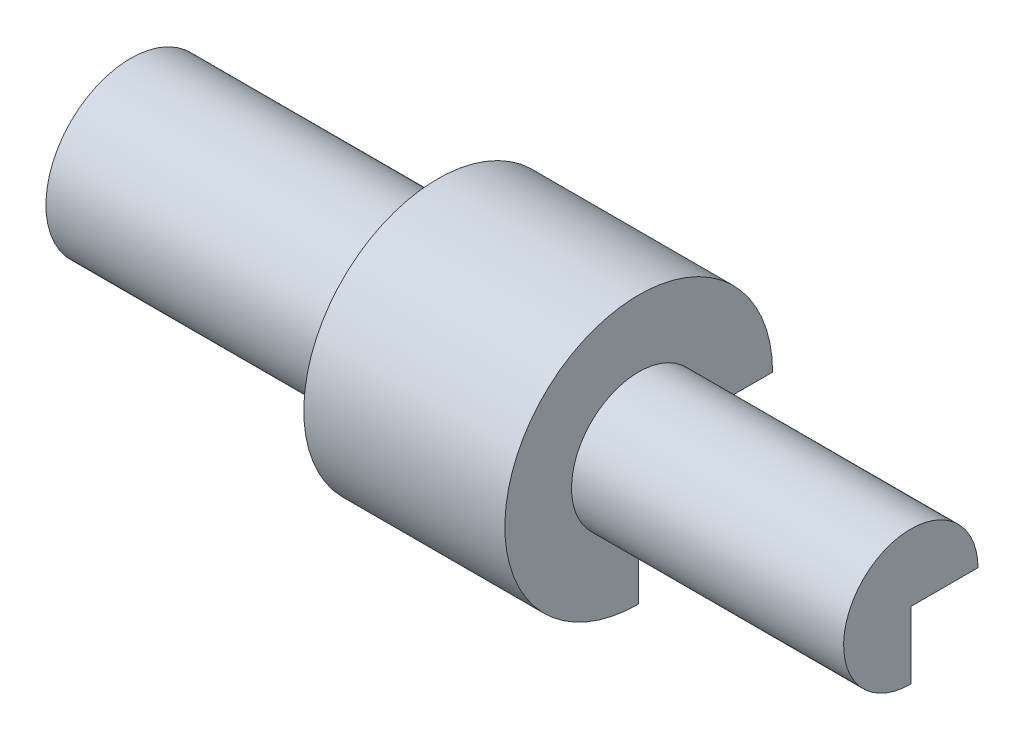
ISO-10303-21;
HEADER;
FILE_DESCRIPTION(('STEP AP214'),'2;1');
FILE_NAME('part.step','',(''),(''),'','','');
FILE_SCHEMA(('AUTOMOTIVE_DESIGN { 1 0 10303 214 1 1 1 1 }'));
ENDSEC;
DATA;
#1=APPLICATION_CONTEXT('core data for automotive mechanical design processes');
#2=APPLICATION_PROTOCOL_DEFINITION('international standard','automotive_design',2000,#1);
#3=PRODUCT_CONTEXT('',#1,'mechanical');
#4=PRODUCT('Part','Part','',(#3));
#5=PRODUCT_RELATED_PRODUCT_CATEGORY('part','',(#4));
#6=PRODUCT_DEFINITION_FORMATION('','',#4);
#7=PRODUCT_DEFINITION_CONTEXT('part definition',#1,'design');
#8=PRODUCT_DEFINITION('design','',#6,#7);
#9=PRODUCT_DEFINITION_SHAPE('','',#8);
#10=(LENGTH_UNIT() NAMED_UNIT(*) SI_UNIT(.MILLI.,.METRE.));
#11=(NAMED_UNIT(*) PLANE_ANGLE_UNIT() SI_UNIT($,.RADIAN.));
#12=(NAMED_UNIT(*) SI_UNIT($,.STERADIAN.) SOLID_ANGLE_UNIT());
#13=UNCERTAINTY_MEASURE_WITH_UNIT(LENGTH_MEASURE(1.E-05),#10,'distance_accuracy_value','');
#14=(GEOMETRIC_REPRESENTATION_CONTEXT(3) GLOBAL_UNCERTAINTY_ASSIGNED_CONTEXT((#13)) GLOBAL_UNIT_ASSIGNED_CONTEXT((#10,
#11,#12)) REPRESENTATION_CONTEXT('',''));
#15=CARTESIAN_POINT('',(0.,0.,0.));
#16=DIRECTION('',(0.,0.,1.));
#17=DIRECTION('',(1.,0.,0.));
#18=AXIS2_PLACEMENT_3D('',#15,#16,#17);
#19=CARTESIAN_POINT('',(0.,0.,0.));
#20=DIRECTION('',(-1.,0.,0.));
#21=DIRECTION('',(0.,0.,1.));
#22=AXIS2_PLACEMENT_3D('',#19,#20,#21);
#23=PLANE('',#22);
#24=DIRECTION('',(0.,0.,-1.));
#25=VECTOR('',#24,1.);
#26=CARTESIAN_POINT('',(0.,0.,0.));
#27=LINE('',#26,#25);
#28=CARTESIAN_POINT('',(0.,0.,0.));
#29=VERTEX_POINT('',#28);
#30=CARTESIAN_POINT('',(0.,0.,-32.5503417358712));
#31=VERTEX_POINT('',#30);
#32=EDGE_CURVE('E145',#29,#31,#27,.T.);
#33=ORIENTED_EDGE('',*,*,#32,.F.);
#34=DIRECTION('',(0.,-1.,0.));
#35=VECTOR('',#34,1.);
#36=CARTESIAN_POINT('',(0.,0.,0.));
#37=LINE('',#36,#35);
#38=CARTESIAN_POINT('',(0.,-32.5503417358712,-3.40946732231284E-13));
#39=VERTEX_POINT('',#38);
#40=EDGE_CURVE('E189',#29,#39,#37,.T.);
#41=ORIENTED_EDGE('',*,*,#40,.T.);
#42=CARTESIAN_POINT('',(0.,0.,0.));
#43=DIRECTION('',(-1.,0.,0.));
#44=DIRECTION('',(0.,0.,1.));
#45=AXIS2_PLACEMENT_3D('',#42,#43,#44);
#46=CIRCLE('',#45,32.5503417358712);
#47=EDGE_CURVE('E55',#39,#31,#46,.T.);
#48=ORIENTED_EDGE('',*,*,#47,.T.);
#49=EDGE_LOOP('',(#33,#41,#48));
#50=FACE_BOUND('',#49,.T.);
#51=ADVANCED_FACE('F39',(#50),#23,.T.);
#52=CARTESIAN_POINT('',(15.1936210798169,0.,0.));
#53=DIRECTION('',(-1.,0.,0.));
#54=DIRECTION('',(0.,0.,1.));
#55=AXIS2_PLACEMENT_3D('',#52,#53,#54);
#56=PLANE('',#55);
#57=CARTESIAN_POINT('',(15.1936210798169,0.,0.));
#58=DIRECTION('',(-1.,0.,0.));
#59=DIRECTION('',(0.,0.,1.));
#60=AXIS2_PLACEMENT_3D('',#57,#58,#59);
#61=CIRCLE('',#60,18.2010773859513);
#62=CARTESIAN_POINT('',(15.1936210798169,-18.2010773859513,-1.90646166119667E-13));
#63=VERTEX_POINT('',#62);
#64=CARTESIAN_POINT('',(15.1936210798169,0.,-18.2010773859513));
#65=VERTEX_POINT('',#64);
#66=EDGE_CURVE('E11',#63,#65,#61,.T.);
#67=ORIENTED_EDGE('',*,*,#66,.F.);
#68=DIRECTION('',(0.,-1.,0.));
#69=VECTOR('',#68,1.);
#70=CARTESIAN_POINT('',(15.1936210798169,0.,0.));
#71=LINE('',#70,#69);
#72=CARTESIAN_POINT('',(15.1936210798169,0.,0.));
#73=VERTEX_POINT('',#72);
#74=EDGE_CURVE('E141',#73,#63,#71,.T.);
#75=ORIENTED_EDGE('',*,*,#74,.F.);
#76=DIRECTION('',(0.,0.,-1.));
#77=VECTOR('',#76,1.);
#78=CARTESIAN_POINT('',(15.1936210798169,0.,0.));
#79=LINE('',#78,#77);
#80=EDGE_CURVE('E140',#73,#65,#79,.T.);
#81=ORIENTED_EDGE('',*,*,#80,.T.);
#82=EDGE_LOOP('',(#67,#75,#81));
#83=FACE_BOUND('',#82,.T.);
#84=ADVANCED_FACE('F41',(#83),#56,.F.);
#85=CARTESIAN_POINT('',(0.,0.,0.));
#86=DIRECTION('',(-1.,0.,0.));
#87=DIRECTION('',(0.,0.,1.));
#88=AXIS2_PLACEMENT_3D('',#85,#86,#87);
#89=CYLINDRICAL_SURFACE('',#88,18.2010773859513);
#90=CARTESIAN_POINT('',(199.080833897966,0.,0.));
#91=DIRECTION('',(-1.,0.,0.));
#92=DIRECTION('',(0.,0.,1.));
#93=AXIS2_PLACEMENT_3D('',#90,#91,#92);
#94=CIRCLE('',#93,18.2010773859513);
#95=CARTESIAN_POINT('',(199.080833897966,-18.2010773859513,-1.90646166119667E-13));
#96=VERTEX_POINT('',#95);
#97=CARTESIAN_POINT('',(199.080833897966,0.,-18.2010773859513));
#98=VERTEX_POINT('',#97);
#99=EDGE_CURVE('E48',#96,#98,#94,.T.);
#100=ORIENTED_EDGE('',*,*,#99,.F.);
#101=DIRECTION('',(1.,0.,0.));
#102=VECTOR('',#101,1.);
#103=CARTESIAN_POINT('',(0.,-18.2010773859513,-1.90646166119667E-13));
#104=LINE('',#103,#102);
#105=EDGE_CURVE('E136',#63,#96,#104,.T.);
#106=ORIENTED_EDGE('',*,*,#105,.F.);
#107=ORIENTED_EDGE('',*,*,#66,.T.);
#108=DIRECTION('',(1.,0.,0.));
#109=VECTOR('',#108,1.);
#110=CARTESIAN_POINT('',(0.,0.,-18.2010773859513));
#111=LINE('',#110,#109);
#112=EDGE_CURVE('E133',#65,#98,#111,.T.);
#113=ORIENTED_EDGE('',*,*,#112,.T.);
#114=EDGE_LOOP('',(#100,#106,#107,#113));
#115=FACE_BOUND('',#114,.T.);
#116=ADVANCED_FACE('F131',(#115),#89,.F.);
#117=CARTESIAN_POINT('',(199.080833897966,0.,0.));
#118=DIRECTION('',(1.,0.,0.));
#119=DIRECTION('',(0.,0.,-1.));
#120=AXIS2_PLACEMENT_3D('',#117,#118,#119);
#121=PLANE('',#120);
#122=CARTESIAN_POINT('',(199.080833897966,0.,0.));
#123=DIRECTION('',(-1.,0.,0.));
#124=DIRECTION('',(0.,0.,1.));
#125=AXIS2_PLACEMENT_3D('',#122,#123,#124);
#126=CIRCLE('',#125,9.10053869297567);
#127=CARTESIAN_POINT('',(199.080833897966,-9.10053869297567,0.));
#128=VERTEX_POINT('',#127);
#129=CARTESIAN_POINT('',(199.080833897966,0.,-9.10053869297567));
#130=VERTEX_POINT('',#129);
#131=EDGE_CURVE('E253',#128,#130,#126,.T.);
#132=ORIENTED_EDGE('',*,*,#131,.F.);
#133=DIRECTION('',(0.,1.,0.));
#134=VECTOR('',#133,1.);
#135=CARTESIAN_POINT('',(199.080833897966,0.,0.));
#136=LINE('',#135,#134);
#137=EDGE_CURVE('E200',#96,#128,#136,.T.);
#138=ORIENTED_EDGE('',*,*,#137,.F.);
#139=ORIENTED_EDGE('',*,*,#99,.T.);
#140=DIRECTION('',(0.,0.,1.));
#141=VECTOR('',#140,1.);
#142=CARTESIAN_POINT('',(199.080833897966,0.,0.));
#143=LINE('',#142,#141);
#144=EDGE_CURVE('E151',#98,#130,#143,.T.);
#145=ORIENTED_EDGE('',*,*,#144,.T.);
#146=EDGE_LOOP('',(#132,#138,#139,#145));
#147=FACE_BOUND('',#146,.T.);
#148=ADVANCED_FACE('F258',(#147),#121,.F.);
#149=CARTESIAN_POINT('',(0.,0.,0.));
#150=DIRECTION('',(-1.,0.,0.));
#151=DIRECTION('',(0.,0.,1.));
#152=AXIS2_PLACEMENT_3D('',#149,#150,#151);
#153=CYLINDRICAL_SURFACE('',#152,9.10053869297567);
#154=CARTESIAN_POINT('',(279.725137873243,0.,0.));
#155=DIRECTION('',(-1.,0.,0.));
#156=DIRECTION('',(0.,0.,1.));
#157=AXIS2_PLACEMENT_3D('',#154,#155,#156);
#158=CIRCLE('',#157,9.10053869297567);
#159=CARTESIAN_POINT('',(279.725137873243,-9.10053869297567,0.));
#160=VERTEX_POINT('',#159);
#161=CARTESIAN_POINT('',(279.725137873243,0.,-9.10053869297567));
#162=VERTEX_POINT('',#161);
#163=EDGE_CURVE('E250',#160,#162,#158,.T.);
#164=ORIENTED_EDGE('',*,*,#163,.F.);
#165=DIRECTION('',(1.,0.,0.));
#166=VECTOR('',#165,1.);
#167=CARTESIAN_POINT('',(0.,-9.10053869297567,0.));
#168=LINE('',#167,#166);
#169=EDGE_CURVE('E204',#128,#160,#168,.T.);
#170=ORIENTED_EDGE('',*,*,#169,.F.);
#171=ORIENTED_EDGE('',*,*,#131,.T.);
#172=DIRECTION('',(1.,0.,0.));
#173=VECTOR('',#172,1.);
#174=CARTESIAN_POINT('',(0.,0.,-9.10053869297567));
#175=LINE('',#174,#173);
#176=EDGE_CURVE('E155',#130,#162,#175,.T.);
#177=ORIENTED_EDGE('',*,*,#176,.T.);
#178=EDGE_LOOP('',(#164,#170,#171,#177));
#179=FACE_BOUND('',#178,.T.);
#180=ADVANCED_FACE('F297',(#179),#153,.F.);
#181=CARTESIAN_POINT('',(279.725137873243,0.,0.));
#182=DIRECTION('',(1.,0.,0.));
#183=DIRECTION('',(0.,0.,-1.));
#184=AXIS2_PLACEMENT_3D('',#181,#182,#183);
#185=PLANE('',#184);
#186=DIRECTION('',(0.,0.,1.));
#187=VECTOR('',#186,1.);
#188=CARTESIAN_POINT('',(279.725137873243,0.,0.));
#189=LINE('',#188,#187);
#190=CARTESIAN_POINT('',(279.725137873243,0.,0.));
#191=VERTEX_POINT('',#190);
#192=EDGE_CURVE('E162',#162,#191,#189,.T.);
#193=ORIENTED_EDGE('',*,*,#192,.T.);
#194=DIRECTION('',(0.,1.,0.));
#195=VECTOR('',#194,1.);
#196=CARTESIAN_POINT('',(279.725137873243,0.,0.));
#197=LINE('',#196,#195);
#198=EDGE_CURVE('E208',#160,#191,#197,.T.);
#199=ORIENTED_EDGE('',*,*,#198,.F.);
#200=ORIENTED_EDGE('',*,*,#163,.T.);
#201=EDGE_LOOP('',(#193,#199,#200));
#202=FACE_BOUND('',#201,.T.);
#203=ADVANCED_FACE('F290',(#202),#185,.F.);
#204=CARTESIAN_POINT('',(299.890300866906,0.,0.));
#205=DIRECTION('',(1.,0.,0.));
#206=DIRECTION('',(0.,0.,-1.));
#207=AXIS2_PLACEMENT_3D('',#204,#205,#206);
#208=PLANE('',#207);
#209=CARTESIAN_POINT('',(299.890300866906,0.,0.));
#210=DIRECTION('',(-1.,0.,0.));
#211=DIRECTION('',(0.,0.,1.));
#212=AXIS2_PLACEMENT_3D('',#209,#210,#211);
#213=CIRCLE('',#212,25.8302711839494);
#214=CARTESIAN_POINT('',(299.890300866906,-25.8302711839494,-2.70557729448051E-13));
#215=VERTEX_POINT('',#214);
#216=CARTESIAN_POINT('',(299.890300866906,0.,-25.8302711839494));
#217=VERTEX_POINT('',#216);
#218=EDGE_CURVE('E247',#215,#217,#213,.T.);
#219=ORIENTED_EDGE('',*,*,#218,.F.);
#220=DIRECTION('',(0.,1.,0.));
#221=VECTOR('',#220,1.);
#222=CARTESIAN_POINT('',(299.890300866906,0.,0.));
#223=LINE('',#222,#221);
#224=CARTESIAN_POINT('',(299.890300866906,0.,0.));
#225=VERTEX_POINT('',#224);
#226=EDGE_CURVE('E212',#215,#225,#223,.T.);
#227=ORIENTED_EDGE('',*,*,#226,.T.);
#228=DIRECTION('',(0.,0.,1.));
#229=VECTOR('',#228,1.);
#230=CARTESIAN_POINT('',(299.890300866906,0.,0.));
#231=LINE('',#230,#229);
#232=EDGE_CURVE('E166',#217,#225,#231,.T.);
#233=ORIENTED_EDGE('',*,*,#232,.F.);
#234=EDGE_LOOP('',(#219,#227,#233));
#235=FACE_BOUND('',#234,.T.);
#236=ADVANCED_FACE('F288',(#235),#208,.T.);
#237=CARTESIAN_POINT('',(0.,0.,0.));
#238=DIRECTION('',(-1.,0.,0.));
#239=DIRECTION('',(0.,0.,1.));
#240=AXIS2_PLACEMENT_3D('',#237,#238,#239);
#241=CYLINDRICAL_SURFACE('',#240,25.8302711839494);
#242=CARTESIAN_POINT('',(195.302050415228,0.,0.));
#243=DIRECTION('',(-1.,0.,0.));
#244=DIRECTION('',(0.,0.,1.));
#245=AXIS2_PLACEMENT_3D('',#242,#243,#244);
#246=CIRCLE('',#245,25.8302711839494);
#247=CARTESIAN_POINT('',(195.302050415228,-25.8302711839494,-2.70557729448051E-13));
#248=VERTEX_POINT('',#247);
#249=CARTESIAN_POINT('',(195.302050415228,0.,-25.8302711839494));
#250=VERTEX_POINT('',#249);
#251=EDGE_CURVE('E244',#248,#250,#246,.T.);
#252=ORIENTED_EDGE('',*,*,#251,.F.);
#253=DIRECTION('',(1.,0.,0.));
#254=VECTOR('',#253,1.);
#255=CARTESIAN_POINT('',(0.,-25.8302711839494,-2.70557729448051E-13));
#256=LINE('',#255,#254);
#257=EDGE_CURVE('E216',#248,#215,#256,.T.);
#258=ORIENTED_EDGE('',*,*,#257,.T.);
#259=ORIENTED_EDGE('',*,*,#218,.T.);
#260=DIRECTION('',(1.,0.,0.));
#261=VECTOR('',#260,1.);
#262=CARTESIAN_POINT('',(0.,0.,-25.8302711839494));
#263=LINE('',#262,#261);
#264=EDGE_CURVE('E169',#250,#217,#263,.T.);
#265=ORIENTED_EDGE('',*,*,#264,.F.);
#266=EDGE_LOOP('',(#252,#258,#259,#265));
#267=FACE_BOUND('',#266,.T.);
#268=ADVANCED_FACE('F280',(#267),#241,.T.);
#269=CARTESIAN_POINT('',(195.302050415228,0.,0.));
#270=DIRECTION('',(1.,0.,0.));
#271=DIRECTION('',(0.,0.,-1.));
#272=AXIS2_PLACEMENT_3D('',#269,#270,#271);
#273=PLANE('',#272);
#274=CARTESIAN_POINT('',(195.302050415228,0.,0.));
#275=DIRECTION('',(-1.,0.,0.));
#276=DIRECTION('',(0.,0.,1.));
#277=AXIS2_PLACEMENT_3D('',#274,#275,#276);
#278=CIRCLE('',#277,51.4505401631513);
#279=CARTESIAN_POINT('',(195.302050415228,-51.4505401631513,-5.38915802559126E-13));
#280=VERTEX_POINT('',#279);
#281=CARTESIAN_POINT('',(195.302050415228,0.,-51.4505401631513));
#282=VERTEX_POINT('',#281);
#283=EDGE_CURVE('E241',#280,#282,#278,.T.);
#284=ORIENTED_EDGE('',*,*,#283,.F.);
#285=DIRECTION('',(0.,1.,0.));
#286=VECTOR('',#285,1.);
#287=CARTESIAN_POINT('',(195.302050415228,0.,0.));
#288=LINE('',#287,#286);
#289=EDGE_CURVE('E220',#280,#248,#288,.T.);
#290=ORIENTED_EDGE('',*,*,#289,.T.);
#291=ORIENTED_EDGE('',*,*,#251,.T.);
#292=DIRECTION('',(0.,0.,1.));
#293=VECTOR('',#292,1.);
#294=CARTESIAN_POINT('',(195.302050415228,0.,0.));
#295=LINE('',#294,#293);
#296=EDGE_CURVE('E173',#282,#250,#295,.T.);
#297=ORIENTED_EDGE('',*,*,#296,.F.);
#298=EDGE_LOOP('',(#284,#290,#291,#297));
#299=FACE_BOUND('',#298,.T.);
#300=ADVANCED_FACE('F276',(#299),#273,.T.);
#301=CARTESIAN_POINT('',(0.,0.,0.));
#302=DIRECTION('',(-1.,0.,0.));
#303=DIRECTION('',(0.,0.,1.));
#304=AXIS2_PLACEMENT_3D('',#301,#302,#303);
#305=CYLINDRICAL_SURFACE('',#304,51.4505401631513);
#306=CARTESIAN_POINT('',(118.021239068127,0.,0.));
#307=DIRECTION('',(-1.,0.,0.));
#308=DIRECTION('',(0.,0.,1.));
#309=AXIS2_PLACEMENT_3D('',#306,#307,#308);
#310=CIRCLE('',#309,51.4505401631513);
#311=CARTESIAN_POINT('',(118.021239068127,-51.4505401631513,-5.38915802559126E-13));
#312=VERTEX_POINT('',#311);
#313=CARTESIAN_POINT('',(118.021239068127,0.,-51.4505401631513));
#314=VERTEX_POINT('',#313);
#315=EDGE_CURVE('E238',#312,#314,#310,.T.);
#316=ORIENTED_EDGE('',*,*,#315,.F.);
#317=DIRECTION('',(1.,0.,0.));
#318=VECTOR('',#317,1.);
#319=CARTESIAN_POINT('',(0.,-51.4505401631513,-5.38915802559126E-13));
#320=LINE('',#319,#318);
#321=EDGE_CURVE('E224',#312,#280,#320,.T.);
#322=ORIENTED_EDGE('',*,*,#321,.T.);
#323=ORIENTED_EDGE('',*,*,#283,.T.);
#324=DIRECTION('',(1.,0.,0.));
#325=VECTOR('',#324,1.);
#326=CARTESIAN_POINT('',(0.,0.,-51.4505401631513));
#327=LINE('',#326,#325);
#328=EDGE_CURVE('E177',#314,#282,#327,.T.);
#329=ORIENTED_EDGE('',*,*,#328,.F.);
#330=EDGE_LOOP('',(#316,#322,#323,#329));
#331=FACE_BOUND('',#330,.T.);
#332=ADVANCED_FACE('F273',(#331),#305,.T.);
#333=CARTESIAN_POINT('',(118.021239068127,0.,0.));
#334=DIRECTION('',(-1.,0.,0.));
#335=DIRECTION('',(0.,0.,1.));
#336=AXIS2_PLACEMENT_3D('',#333,#334,#335);
#337=PLANE('',#336);
#338=CARTESIAN_POINT('',(118.021239068127,0.,0.));
#339=DIRECTION('',(-1.,0.,0.));
#340=DIRECTION('',(0.,0.,1.));
#341=AXIS2_PLACEMENT_3D('',#338,#339,#340);
#342=CIRCLE('',#341,32.5503417358712);
#343=CARTESIAN_POINT('',(118.021239068127,-32.5503417358712,-3.40946732231284E-13));
#344=VERTEX_POINT('',#343);
#345=CARTESIAN_POINT('',(118.021239068127,0.,-32.5503417358712));
#346=VERTEX_POINT('',#345);
#347=EDGE_CURVE('E63',#344,#346,#342,.T.);
#348=ORIENTED_EDGE('',*,*,#347,.F.);
#349=DIRECTION('',(0.,-1.,0.));
#350=VECTOR('',#349,1.);
#351=CARTESIAN_POINT('',(118.021239068127,0.,0.));
#352=LINE('',#351,#350);
#353=EDGE_CURVE('E228',#344,#312,#352,.T.);
#354=ORIENTED_EDGE('',*,*,#353,.T.);
#355=ORIENTED_EDGE('',*,*,#315,.T.);
#356=DIRECTION('',(0.,0.,-1.));
#357=VECTOR('',#356,1.);
#358=CARTESIAN_POINT('',(118.021239068127,0.,0.));
#359=LINE('',#358,#357);
#360=EDGE_CURVE('E181',#346,#314,#359,.T.);
#361=ORIENTED_EDGE('',*,*,#360,.F.);
#362=EDGE_LOOP('',(#348,#354,#355,#361));
#363=FACE_BOUND('',#362,.T.);
#364=ADVANCED_FACE('F269',(#363),#337,.T.);
#365=CARTESIAN_POINT('',(0.,0.,0.));
#366=DIRECTION('',(-1.,0.,0.));
#367=DIRECTION('',(0.,0.,1.));
#368=AXIS2_PLACEMENT_3D('',#365,#366,#367);
#369=CYLINDRICAL_SURFACE('',#368,32.5503417358712);
#370=DIRECTION('',(1.,0.,0.));
#371=VECTOR('',#370,1.);
#372=CARTESIAN_POINT('',(0.,-32.5503417358712,-3.40946732231284E-13));
#373=LINE('',#372,#371);
#374=EDGE_CURVE('E231',#39,#344,#373,.T.);
#375=ORIENTED_EDGE('',*,*,#374,.T.);
#376=ORIENTED_EDGE('',*,*,#347,.T.);
#377=DIRECTION('',(1.,0.,0.));
#378=VECTOR('',#377,1.);
#379=CARTESIAN_POINT('',(0.,0.,-32.5503417358712));
#380=LINE('',#379,#378);
#381=EDGE_CURVE('E185',#31,#346,#380,.T.);
#382=ORIENTED_EDGE('',*,*,#381,.F.);
#383=ORIENTED_EDGE('',*,*,#47,.F.);
#384=EDGE_LOOP('',(#375,#376,#382,#383));
#385=FACE_BOUND('',#384,.T.);
#386=ADVANCED_FACE('F268',(#385),#369,.T.);
#387=CARTESIAN_POINT('',(0.,0.,0.));
#388=DIRECTION('',(0.,0.,-1.));
#389=DIRECTION('',(0.,1.,0.));
#390=AXIS2_PLACEMENT_3D('',#387,#388,#389);
#391=PLANE('',#390);
#392=ORIENTED_EDGE('',*,*,#40,.F.);
#393=DIRECTION('',(1.,0.,0.));
#394=VECTOR('',#393,1.);
#395=CARTESIAN_POINT('',(0.,0.,0.));
#396=LINE('',#395,#394);
#397=EDGE_CURVE('E192',#29,#73,#396,.T.);
#398=ORIENTED_EDGE('',*,*,#397,.T.);
#399=ORIENTED_EDGE('',*,*,#74,.T.);
#400=ORIENTED_EDGE('',*,*,#105,.T.);
#401=ORIENTED_EDGE('',*,*,#137,.T.);
#402=ORIENTED_EDGE('',*,*,#169,.T.);
#403=ORIENTED_EDGE('',*,*,#198,.T.);
#404=EDGE_CURVE('E195',#191,#225,#396,.T.);
#405=ORIENTED_EDGE('',*,*,#404,.T.);
#406=ORIENTED_EDGE('',*,*,#226,.F.);
#407=ORIENTED_EDGE('',*,*,#257,.F.);
#408=ORIENTED_EDGE('',*,*,#289,.F.);
#409=ORIENTED_EDGE('',*,*,#321,.F.);
#410=ORIENTED_EDGE('',*,*,#353,.F.);
#411=ORIENTED_EDGE('',*,*,#374,.F.);
#412=EDGE_LOOP('',(#392,#398,#399,#400,#401,#402,#403,#405,#406,#407,#408,#409,#410,#411));
#413=FACE_BOUND('',#412,.T.);
#414=ADVANCED_FACE('F261',(#413),#391,.T.);
#415=CARTESIAN_POINT('',(0.,0.,0.));
#416=DIRECTION('',(0.,1.,0.));
#417=DIRECTION('',(0.,0.,1.));
#418=AXIS2_PLACEMENT_3D('',#415,#416,#417);
#419=PLANE('',#418);
#420=ORIENTED_EDGE('',*,*,#32,.T.);
#421=ORIENTED_EDGE('',*,*,#381,.T.);
#422=ORIENTED_EDGE('',*,*,#360,.T.);
#423=ORIENTED_EDGE('',*,*,#328,.T.);
#424=ORIENTED_EDGE('',*,*,#296,.T.);
#425=ORIENTED_EDGE('',*,*,#264,.T.);
#426=ORIENTED_EDGE('',*,*,#232,.T.);
#427=ORIENTED_EDGE('',*,*,#404,.F.);
#428=ORIENTED_EDGE('',*,*,#192,.F.);
#429=ORIENTED_EDGE('',*,*,#176,.F.);
#430=ORIENTED_EDGE('',*,*,#144,.F.);
#431=ORIENTED_EDGE('',*,*,#112,.F.);
#432=ORIENTED_EDGE('',*,*,#80,.F.);
#433=ORIENTED_EDGE('',*,*,#397,.F.);
#434=EDGE_LOOP('',(#420,#421,#422,#423,#424,#425,#426,#427,#428,#429,#430,#431,#432,#433));
#435=FACE_BOUND('',#434,.T.);
#436=ADVANCED_FACE('F148',(#435),#419,.F.);
#437=CLOSED_SHELL('',(#51,#84,#116,#148,#180,#203,#236,#268,#300,#332,#364,#386,#414,#436));
#438=MANIFOLD_SOLID_BREP('B2',#437);
#439=ADVANCED_BREP_SHAPE_REPRESENTATION('',(#18,#438),#14);
#440=SHAPE_DEFINITION_REPRESENTATION(#9,#439);
ENDSEC;
END-ISO-10303-21;
